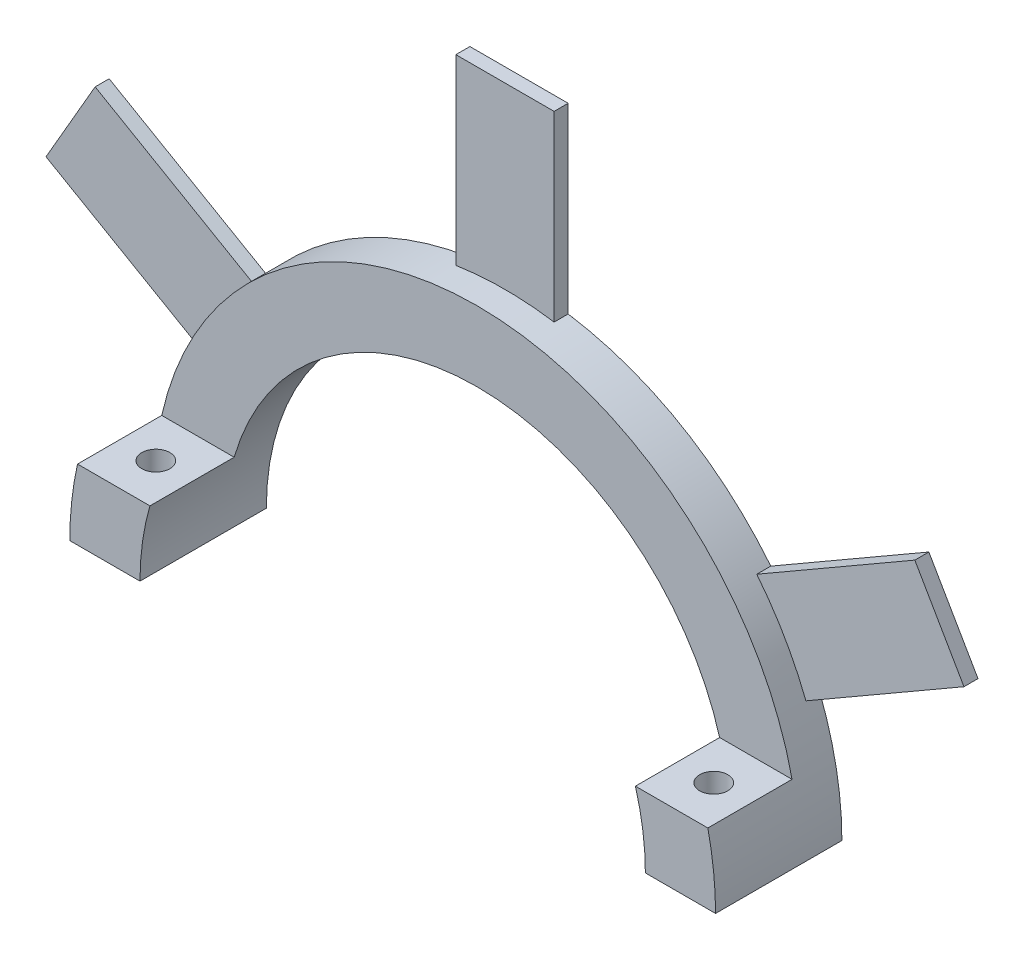
ISO-10303-21;
HEADER;
FILE_DESCRIPTION(('STEP AP214'),'2;1');
FILE_NAME('part.step','',(''),(''),'','','');
FILE_SCHEMA(('AUTOMOTIVE_DESIGN { 1 0 10303 214 1 1 1 1 }'));
ENDSEC;
DATA;
#1=APPLICATION_CONTEXT('core data for automotive mechanical design processes');
#2=APPLICATION_PROTOCOL_DEFINITION('international standard','automotive_design',2000,#1);
#3=PRODUCT_CONTEXT('',#1,'mechanical');
#4=PRODUCT('Part','Part','',(#3));
#5=PRODUCT_RELATED_PRODUCT_CATEGORY('part','',(#4));
#6=PRODUCT_DEFINITION_FORMATION('','',#4);
#7=PRODUCT_DEFINITION_CONTEXT('part definition',#1,'design');
#8=PRODUCT_DEFINITION('design','',#6,#7);
#9=PRODUCT_DEFINITION_SHAPE('','',#8);
#10=(LENGTH_UNIT() NAMED_UNIT(*) SI_UNIT(.MILLI.,.METRE.));
#11=(NAMED_UNIT(*) PLANE_ANGLE_UNIT() SI_UNIT($,.RADIAN.));
#12=(NAMED_UNIT(*) SI_UNIT($,.STERADIAN.) SOLID_ANGLE_UNIT());
#13=UNCERTAINTY_MEASURE_WITH_UNIT(LENGTH_MEASURE(1.E-05),#10,'distance_accuracy_value','');
#14=(GEOMETRIC_REPRESENTATION_CONTEXT(3) GLOBAL_UNCERTAINTY_ASSIGNED_CONTEXT((#13)) GLOBAL_UNIT_ASSIGNED_CONTEXT((#10,
#11,#12)) REPRESENTATION_CONTEXT('',''));
#15=CARTESIAN_POINT('',(0.,0.,0.));
#16=DIRECTION('',(0.,0.,1.));
#17=DIRECTION('',(1.,0.,0.));
#18=AXIS2_PLACEMENT_3D('',#15,#16,#17);
#19=CARTESIAN_POINT('',(0.,0.,3.));
#20=DIRECTION('',(0.,0.,1.));
#21=DIRECTION('',(1.,0.,0.));
#22=AXIS2_PLACEMENT_3D('',#19,#20,#21);
#23=PLANE('',#22);
#24=DIRECTION('',(-1.,0.,0.));
#25=VECTOR('',#24,1.);
#26=CARTESIAN_POINT('',(0.,5.,3.));
#27=LINE('',#26,#25);
#28=CARTESIAN_POINT('',(22.4499443206436,5.,3.));
#29=VERTEX_POINT('',#28);
#30=CARTESIAN_POINT('',(17.2916164657906,5.,3.));
#31=VERTEX_POINT('',#30);
#32=EDGE_CURVE('E363',#29,#31,#27,.T.);
#33=ORIENTED_EDGE('',*,*,#32,.F.);
#34=CARTESIAN_POINT('',(0.,0.,3.));
#35=DIRECTION('',(0.,0.,1.));
#36=DIRECTION('',(1.,0.,0.));
#37=AXIS2_PLACEMENT_3D('',#34,#35,#36);
#38=CIRCLE('',#37,23.);
#39=CARTESIAN_POINT('',(-22.4499443206436,5.,3.));
#40=VERTEX_POINT('',#39);
#41=EDGE_CURVE('E316',#29,#40,#38,.T.);
#42=ORIENTED_EDGE('',*,*,#41,.T.);
#43=DIRECTION('',(1.,0.,0.));
#44=VECTOR('',#43,1.);
#45=CARTESIAN_POINT('',(0.,5.,3.));
#46=LINE('',#45,#44);
#47=CARTESIAN_POINT('',(-17.2916164657906,5.,3.));
#48=VERTEX_POINT('',#47);
#49=EDGE_CURVE('E340',#40,#48,#46,.T.);
#50=ORIENTED_EDGE('',*,*,#49,.T.);
#51=CARTESIAN_POINT('',(0.,0.,3.));
#52=DIRECTION('',(0.,0.,1.));
#53=DIRECTION('',(1.,0.,0.));
#54=AXIS2_PLACEMENT_3D('',#51,#52,#53);
#55=CIRCLE('',#54,18.);
#56=EDGE_CURVE('E318',#31,#48,#55,.T.);
#57=ORIENTED_EDGE('',*,*,#56,.F.);
#58=EDGE_LOOP('',(#33,#42,#50,#57));
#59=FACE_BOUND('',#58,.T.);
#60=ADVANCED_FACE('F40',(#59),#23,.T.);
#61=CARTESIAN_POINT('',(-1.75000000000156,-3.03108891324824,3.));
#62=DIRECTION('',(0.499999999999999,0.866025403784439,0.));
#63=DIRECTION('',(-0.866025403784439,0.499999999999999,0.));
#64=AXIS2_PLACEMENT_3D('',#61,#62,#63);
#65=PLANE('',#64);
#66=DIRECTION('',(0.866025403784439,-0.499999999999999,0.));
#67=VECTOR('',#66,1.);
#68=CARTESIAN_POINT('',(-1.75000000000156,-3.03108891324824,1.));
#69=LINE('',#68,#67);
#70=CARTESIAN_POINT('',(-32.6949373718029,14.8349790084174,1.));
#71=VERTEX_POINT('',#70);
#72=CARTESIAN_POINT('',(-21.4366071226116,8.33497900841983,1.));
#73=VERTEX_POINT('',#72);
#74=EDGE_CURVE('E182',#71,#73,#69,.T.);
#75=ORIENTED_EDGE('',*,*,#74,.F.);
#76=DIRECTION('',(0.,0.,-1.));
#77=VECTOR('',#76,1.);
#78=CARTESIAN_POINT('',(-32.6949373718029,14.8349790084174,3.));
#79=LINE('',#78,#77);
#80=CARTESIAN_POINT('',(-32.6949373718029,14.8349790084174,0.));
#81=VERTEX_POINT('',#80);
#82=EDGE_CURVE('E209',#71,#81,#79,.T.);
#83=ORIENTED_EDGE('',*,*,#82,.T.);
#84=DIRECTION('',(0.866025403784439,-0.499999999999999,0.));
#85=VECTOR('',#84,1.);
#86=CARTESIAN_POINT('',(-1.75000000000156,-3.03108891324824,0.));
#87=LINE('',#86,#85);
#88=CARTESIAN_POINT('',(-21.4366071226084,8.3349790084186,0.));
#89=VERTEX_POINT('',#88);
#90=EDGE_CURVE('E260',#81,#89,#87,.T.);
#91=ORIENTED_EDGE('',*,*,#90,.T.);
#92=DIRECTION('',(0.,0.,-1.));
#93=VECTOR('',#92,1.);
#94=CARTESIAN_POINT('',(-21.4366071226084,8.3349790084186,3.));
#95=LINE('',#94,#93);
#96=EDGE_CURVE('E11',#73,#89,#95,.T.);
#97=ORIENTED_EDGE('',*,*,#96,.F.);
#98=EDGE_LOOP('',(#75,#83,#91,#97));
#99=FACE_BOUND('',#98,.T.);
#100=ADVANCED_FACE('F42',(#99),#65,.F.);
#101=CARTESIAN_POINT('',(1.7499999999976,-3.03108891324137,3.));
#102=DIRECTION('',(0.5,-0.866025403784438,0.));
#103=DIRECTION('',(0.866025403784439,0.5,0.));
#104=AXIS2_PLACEMENT_3D('',#101,#102,#103);
#105=PLANE('',#104);
#106=DIRECTION('',(0.,0.,-1.));
#107=VECTOR('',#106,1.);
#108=CARTESIAN_POINT('',(32.6949373718109,14.8349790084311,3.));
#109=LINE('',#108,#107);
#110=CARTESIAN_POINT('',(32.6949373718109,14.8349790084311,1.));
#111=VERTEX_POINT('',#110);
#112=CARTESIAN_POINT('',(32.6949373718109,14.8349790084311,0.));
#113=VERTEX_POINT('',#112);
#114=EDGE_CURVE('E227',#111,#113,#109,.T.);
#115=ORIENTED_EDGE('',*,*,#114,.F.);
#116=DIRECTION('',(0.866025403784439,0.5,0.));
#117=VECTOR('',#116,1.);
#118=CARTESIAN_POINT('',(1.7499999999976,-3.03108891324137,1.));
#119=LINE('',#118,#117);
#120=CARTESIAN_POINT('',(21.4366071226108,8.33497900842975,1.));
#121=VERTEX_POINT('',#120);
#122=EDGE_CURVE('E403',#121,#111,#119,.T.);
#123=ORIENTED_EDGE('',*,*,#122,.F.);
#124=DIRECTION('',(0.,0.,-1.));
#125=VECTOR('',#124,1.);
#126=CARTESIAN_POINT('',(21.4366071226106,8.33497900843012,3.));
#127=LINE('',#126,#125);
#128=CARTESIAN_POINT('',(21.4366071226106,8.33497900843012,0.));
#129=VERTEX_POINT('',#128);
#130=EDGE_CURVE('E230',#121,#129,#127,.T.);
#131=ORIENTED_EDGE('',*,*,#130,.T.);
#132=DIRECTION('',(-0.866025403784439,-0.5,0.));
#133=VECTOR('',#132,1.);
#134=CARTESIAN_POINT('',(1.7499999999976,-3.03108891324137,0.));
#135=LINE('',#134,#133);
#136=EDGE_CURVE('E277',#113,#129,#135,.T.);
#137=ORIENTED_EDGE('',*,*,#136,.F.);
#138=EDGE_LOOP('',(#115,#123,#131,#137));
#139=FACE_BOUND('',#138,.T.);
#140=ADVANCED_FACE('F450',(#139),#105,.T.);
#141=CARTESIAN_POINT('',(30.9449373718133,17.8660679216725,3.));
#142=DIRECTION('',(0.866025403784438,0.500000000000001,0.));
#143=DIRECTION('',(-0.500000000000001,0.866025403784438,0.));
#144=AXIS2_PLACEMENT_3D('',#141,#142,#143);
#145=PLANE('',#144);
#146=DIRECTION('',(0.,0.,-1.));
#147=VECTOR('',#146,1.);
#148=CARTESIAN_POINT('',(29.1949373718109,20.8971568349222,3.));
#149=LINE('',#148,#147);
#150=CARTESIAN_POINT('',(29.1949373718109,20.8971568349222,1.));
#151=VERTEX_POINT('',#150);
#152=CARTESIAN_POINT('',(29.1949373718109,20.8971568349222,0.));
#153=VERTEX_POINT('',#152);
#154=EDGE_CURVE('E224',#151,#153,#149,.T.);
#155=ORIENTED_EDGE('',*,*,#154,.F.);
#156=DIRECTION('',(-0.500000000000001,0.866025403784438,0.));
#157=VECTOR('',#156,1.);
#158=CARTESIAN_POINT('',(30.9449373718133,17.8660679216725,1.));
#159=LINE('',#158,#157);
#160=EDGE_CURVE('E400',#111,#151,#159,.T.);
#161=ORIENTED_EDGE('',*,*,#160,.F.);
#162=ORIENTED_EDGE('',*,*,#114,.T.);
#163=DIRECTION('',(0.500000000000001,-0.866025403784438,0.));
#164=VECTOR('',#163,1.);
#165=CARTESIAN_POINT('',(30.9449373718133,17.8660679216725,0.));
#166=LINE('',#165,#164);
#167=EDGE_CURVE('E282',#153,#113,#166,.T.);
#168=ORIENTED_EDGE('',*,*,#167,.F.);
#169=EDGE_LOOP('',(#155,#161,#162,#168));
#170=FACE_BOUND('',#169,.T.);
#171=ADVANCED_FACE('F442',(#170),#145,.T.);
#172=CARTESIAN_POINT('',(-1.7500000000024,3.0310889132497,3.));
#173=DIRECTION('',(0.5,-0.866025403784438,0.));
#174=DIRECTION('',(0.866025403784439,0.5,0.));
#175=AXIS2_PLACEMENT_3D('',#172,#173,#174);
#176=PLANE('',#175);
#177=DIRECTION('',(-0.866025403784439,-0.5,0.));
#178=VECTOR('',#177,1.);
#179=CARTESIAN_POINT('',(-1.7500000000024,3.0310889132497,1.));
#180=LINE('',#179,#178);
#181=CARTESIAN_POINT('',(17.9366071226104,14.39715683492,1.));
#182=VERTEX_POINT('',#181);
#183=EDGE_CURVE('E56',#151,#182,#180,.T.);
#184=ORIENTED_EDGE('',*,*,#183,.F.);
#185=ORIENTED_EDGE('',*,*,#154,.T.);
#186=DIRECTION('',(-0.866025403784439,-0.5,0.));
#187=VECTOR('',#186,1.);
#188=CARTESIAN_POINT('',(-1.7500000000024,3.0310889132497,0.));
#189=LINE('',#188,#187);
#190=CARTESIAN_POINT('',(17.9366071226104,14.39715683492,0.));
#191=VERTEX_POINT('',#190);
#192=EDGE_CURVE('E288',#153,#191,#189,.T.);
#193=ORIENTED_EDGE('',*,*,#192,.T.);
#194=DIRECTION('',(0.,0.,-1.));
#195=VECTOR('',#194,1.);
#196=CARTESIAN_POINT('',(17.9366071226104,14.39715683492,3.));
#197=LINE('',#196,#195);
#198=EDGE_CURVE('E221',#182,#191,#197,.T.);
#199=ORIENTED_EDGE('',*,*,#198,.F.);
#200=EDGE_LOOP('',(#184,#185,#193,#199));
#201=FACE_BOUND('',#200,.T.);
#202=ADVANCED_FACE('F507',(#201),#176,.F.);
#203=CARTESIAN_POINT('',(3.5,0.,3.));
#204=DIRECTION('',(1.,0.,0.));
#205=DIRECTION('',(0.,1.,0.));
#206=AXIS2_PLACEMENT_3D('',#203,#204,#205);
#207=PLANE('',#206);
#208=DIRECTION('',(0.,0.,-1.));
#209=VECTOR('',#208,1.);
#210=CARTESIAN_POINT('',(3.5,35.7321358433386,3.));
#211=LINE('',#210,#209);
#212=CARTESIAN_POINT('',(3.5,35.7321358433386,1.));
#213=VERTEX_POINT('',#212);
#214=CARTESIAN_POINT('',(3.5,35.7321358433386,0.));
#215=VERTEX_POINT('',#214);
#216=EDGE_CURVE('E215',#213,#215,#211,.T.);
#217=ORIENTED_EDGE('',*,*,#216,.F.);
#218=DIRECTION('',(0.,1.,0.));
#219=VECTOR('',#218,1.);
#220=CARTESIAN_POINT('',(3.5,0.,1.));
#221=LINE('',#220,#219);
#222=CARTESIAN_POINT('',(3.5,22.7321358433386,1.));
#223=VERTEX_POINT('',#222);
#224=EDGE_CURVE('E414',#223,#213,#221,.T.);
#225=ORIENTED_EDGE('',*,*,#224,.F.);
#226=DIRECTION('',(0.,0.,-1.));
#227=VECTOR('',#226,1.);
#228=CARTESIAN_POINT('',(3.5,22.7321358433386,3.));
#229=LINE('',#228,#227);
#230=CARTESIAN_POINT('',(3.5,22.7321358433386,0.));
#231=VERTEX_POINT('',#230);
#232=EDGE_CURVE('E218',#223,#231,#229,.T.);
#233=ORIENTED_EDGE('',*,*,#232,.T.);
#234=DIRECTION('',(0.,-1.,0.));
#235=VECTOR('',#234,1.);
#236=CARTESIAN_POINT('',(3.5,0.,0.));
#237=LINE('',#236,#235);
#238=EDGE_CURVE('E287',#215,#231,#237,.T.);
#239=ORIENTED_EDGE('',*,*,#238,.F.);
#240=EDGE_LOOP('',(#217,#225,#233,#239));
#241=FACE_BOUND('',#240,.T.);
#242=ADVANCED_FACE('F434',(#241),#207,.T.);
#243=CARTESIAN_POINT('',(0.,35.7321358433386,3.));
#244=DIRECTION('',(0.,1.,0.));
#245=DIRECTION('',(0.,0.,1.));
#246=AXIS2_PLACEMENT_3D('',#243,#244,#245);
#247=PLANE('',#246);
#248=DIRECTION('',(0.,0.,-1.));
#249=VECTOR('',#248,1.);
#250=CARTESIAN_POINT('',(-3.5,35.7321358433386,3.));
#251=LINE('',#250,#249);
#252=CARTESIAN_POINT('',(-3.5,35.7321358433386,1.));
#253=VERTEX_POINT('',#252);
#254=CARTESIAN_POINT('',(-3.5,35.7321358433386,0.));
#255=VERTEX_POINT('',#254);
#256=EDGE_CURVE('E207',#253,#255,#251,.T.);
#257=ORIENTED_EDGE('',*,*,#256,.F.);
#258=DIRECTION('',(-1.,0.,0.));
#259=VECTOR('',#258,1.);
#260=CARTESIAN_POINT('',(0.,35.7321358433386,1.));
#261=LINE('',#260,#259);
#262=EDGE_CURVE('E411',#213,#253,#261,.T.);
#263=ORIENTED_EDGE('',*,*,#262,.F.);
#264=ORIENTED_EDGE('',*,*,#216,.T.);
#265=DIRECTION('',(1.,0.,0.));
#266=VECTOR('',#265,1.);
#267=CARTESIAN_POINT('',(0.,35.7321358433386,0.));
#268=LINE('',#267,#266);
#269=EDGE_CURVE('E294',#255,#215,#268,.T.);
#270=ORIENTED_EDGE('',*,*,#269,.F.);
#271=EDGE_LOOP('',(#257,#263,#264,#270));
#272=FACE_BOUND('',#271,.T.);
#273=ADVANCED_FACE('F428',(#272),#247,.T.);
#274=CARTESIAN_POINT('',(-3.49999999999999,0.,3.));
#275=DIRECTION('',(1.,0.,0.));
#276=DIRECTION('',(0.,1.,0.));
#277=AXIS2_PLACEMENT_3D('',#274,#275,#276);
#278=PLANE('',#277);
#279=DIRECTION('',(0.,-1.,0.));
#280=VECTOR('',#279,1.);
#281=CARTESIAN_POINT('',(-3.49999999999999,0.,1.));
#282=LINE('',#281,#280);
#283=CARTESIAN_POINT('',(-3.5,22.7321358433386,1.));
#284=VERTEX_POINT('',#283);
#285=EDGE_CURVE('E64',#253,#284,#282,.T.);
#286=ORIENTED_EDGE('',*,*,#285,.F.);
#287=ORIENTED_EDGE('',*,*,#256,.T.);
#288=DIRECTION('',(0.,-1.,0.));
#289=VECTOR('',#288,1.);
#290=CARTESIAN_POINT('',(-3.49999999999999,0.,0.));
#291=LINE('',#290,#289);
#292=CARTESIAN_POINT('',(-3.5,22.7321358433386,0.));
#293=VERTEX_POINT('',#292);
#294=EDGE_CURVE('E300',#255,#293,#291,.T.);
#295=ORIENTED_EDGE('',*,*,#294,.T.);
#296=DIRECTION('',(0.,0.,-1.));
#297=VECTOR('',#296,1.);
#298=CARTESIAN_POINT('',(-3.5,22.7321358433386,3.));
#299=LINE('',#298,#297);
#300=EDGE_CURVE('E203',#284,#293,#299,.T.);
#301=ORIENTED_EDGE('',*,*,#300,.F.);
#302=EDGE_LOOP('',(#286,#287,#295,#301));
#303=FACE_BOUND('',#302,.T.);
#304=ADVANCED_FACE('F498',(#303),#278,.F.);
#305=CARTESIAN_POINT('',(1.74999999999843,3.03108891324283,3.));
#306=DIRECTION('',(0.499999999999999,0.866025403784439,0.));
#307=DIRECTION('',(-0.866025403784439,0.499999999999999,0.));
#308=AXIS2_PLACEMENT_3D('',#305,#306,#307);
#309=PLANE('',#308);
#310=DIRECTION('',(0.,0.,-1.));
#311=VECTOR('',#310,1.);
#312=CARTESIAN_POINT('',(-29.1949373718029,20.8971568349084,3.));
#313=LINE('',#312,#311);
#314=CARTESIAN_POINT('',(-29.1949373718029,20.8971568349084,1.));
#315=VERTEX_POINT('',#314);
#316=CARTESIAN_POINT('',(-29.1949373718029,20.8971568349084,0.));
#317=VERTEX_POINT('',#316);
#318=EDGE_CURVE('E194',#315,#317,#313,.T.);
#319=ORIENTED_EDGE('',*,*,#318,.F.);
#320=DIRECTION('',(-0.866025403784439,0.499999999999999,0.));
#321=VECTOR('',#320,1.);
#322=CARTESIAN_POINT('',(1.74999999999843,3.03108891324283,1.));
#323=LINE('',#322,#321);
#324=CARTESIAN_POINT('',(-17.9366071226086,14.3971568349104,1.));
#325=VERTEX_POINT('',#324);
#326=EDGE_CURVE('E179',#325,#315,#323,.T.);
#327=ORIENTED_EDGE('',*,*,#326,.F.);
#328=DIRECTION('',(0.,0.,-1.));
#329=VECTOR('',#328,1.);
#330=CARTESIAN_POINT('',(-17.9366071226083,14.3971568349109,3.));
#331=LINE('',#330,#329);
#332=CARTESIAN_POINT('',(-17.9366071226083,14.3971568349109,0.));
#333=VERTEX_POINT('',#332);
#334=EDGE_CURVE('E192',#325,#333,#331,.T.);
#335=ORIENTED_EDGE('',*,*,#334,.T.);
#336=DIRECTION('',(0.866025403784439,-0.499999999999999,0.));
#337=VECTOR('',#336,1.);
#338=CARTESIAN_POINT('',(1.74999999999843,3.03108891324283,0.));
#339=LINE('',#338,#337);
#340=EDGE_CURVE('E299',#317,#333,#339,.T.);
#341=ORIENTED_EDGE('',*,*,#340,.F.);
#342=EDGE_LOOP('',(#319,#327,#335,#341));
#343=FACE_BOUND('',#342,.T.);
#344=ADVANCED_FACE('F190',(#343),#309,.T.);
#345=CARTESIAN_POINT('',(-30.9449373718014,17.8660679216656,3.));
#346=DIRECTION('',(-0.866025403784439,0.5,0.));
#347=DIRECTION('',(-0.5,-0.866025403784439,0.));
#348=AXIS2_PLACEMENT_3D('',#345,#346,#347);
#349=PLANE('',#348);
#350=ORIENTED_EDGE('',*,*,#82,.F.);
#351=DIRECTION('',(-0.5,-0.866025403784439,0.));
#352=VECTOR('',#351,1.);
#353=CARTESIAN_POINT('',(-30.9449373718014,17.8660679216656,1.));
#354=LINE('',#353,#352);
#355=EDGE_CURVE('E196',#315,#71,#354,.T.);
#356=ORIENTED_EDGE('',*,*,#355,.F.);
#357=ORIENTED_EDGE('',*,*,#318,.T.);
#358=DIRECTION('',(0.5,0.866025403784439,0.));
#359=VECTOR('',#358,1.);
#360=CARTESIAN_POINT('',(-30.9449373718014,17.8660679216656,0.));
#361=LINE('',#360,#359);
#362=EDGE_CURVE('E303',#81,#317,#361,.T.);
#363=ORIENTED_EDGE('',*,*,#362,.F.);
#364=EDGE_LOOP('',(#350,#356,#357,#363));
#365=FACE_BOUND('',#364,.T.);
#366=ADVANCED_FACE('F424',(#365),#349,.T.);
#367=CARTESIAN_POINT('',(0.,0.,3.));
#368=DIRECTION('',(0.,-1.,0.));
#369=DIRECTION('',(0.,0.,-1.));
#370=AXIS2_PLACEMENT_3D('',#367,#368,#369);
#371=PLANE('',#370);
#372=CARTESIAN_POINT('',(-19.8707803932171,0.,6.));
#373=DIRECTION('',(0.,1.,0.));
#374=DIRECTION('',(0.,0.,1.));
#375=AXIS2_PLACEMENT_3D('',#372,#373,#374);
#376=CIRCLE('',#375,1.);
#377=CARTESIAN_POINT('',(-19.8707803932171,0.,7.));
#378=VERTEX_POINT('',#377);
#379=EDGE_CURVE('E368',#378,#378,#376,.T.);
#380=ORIENTED_EDGE('',*,*,#379,.T.);
#381=EDGE_LOOP('',(#380));
#382=FACE_BOUND('',#381,.T.);
#383=DIRECTION('',(-1.,0.,0.));
#384=VECTOR('',#383,1.);
#385=CARTESIAN_POINT('',(0.,0.,0.));
#386=LINE('',#385,#384);
#387=CARTESIAN_POINT('',(-18.,0.,0.));
#388=VERTEX_POINT('',#387);
#389=CARTESIAN_POINT('',(-23.,0.,0.));
#390=VERTEX_POINT('',#389);
#391=EDGE_CURVE('E248',#388,#390,#386,.T.);
#392=ORIENTED_EDGE('',*,*,#391,.F.);
#393=DIRECTION('',(0.,0.,-1.));
#394=VECTOR('',#393,1.);
#395=CARTESIAN_POINT('',(-18.,0.,3.));
#396=LINE('',#395,#394);
#397=CARTESIAN_POINT('',(-18.,0.,9.));
#398=VERTEX_POINT('',#397);
#399=EDGE_CURVE('E239',#398,#388,#396,.T.);
#400=ORIENTED_EDGE('',*,*,#399,.F.);
#401=DIRECTION('',(1.,0.,0.));
#402=VECTOR('',#401,1.);
#403=CARTESIAN_POINT('',(0.,0.,9.));
#404=LINE('',#403,#402);
#405=CARTESIAN_POINT('',(-23.,0.,9.));
#406=VERTEX_POINT('',#405);
#407=EDGE_CURVE('E251',#406,#398,#404,.T.);
#408=ORIENTED_EDGE('',*,*,#407,.F.);
#409=DIRECTION('',(0.,0.,-1.));
#410=VECTOR('',#409,1.);
#411=CARTESIAN_POINT('',(-23.,0.,3.));
#412=LINE('',#411,#410);
#413=EDGE_CURVE('E49',#406,#390,#412,.T.);
#414=ORIENTED_EDGE('',*,*,#413,.T.);
#415=EDGE_LOOP('',(#392,#400,#408,#414));
#416=FACE_BOUND('',#415,.T.);
#417=ADVANCED_FACE('F246',(#382,#416),#371,.T.);
#418=CARTESIAN_POINT('',(0.,0.,3.));
#419=DIRECTION('',(0.,0.,-1.));
#420=DIRECTION('',(-1.,0.,0.));
#421=AXIS2_PLACEMENT_3D('',#418,#419,#420);
#422=CYLINDRICAL_SURFACE('',#421,18.);
#423=CARTESIAN_POINT('',(0.,0.,0.));
#424=DIRECTION('',(0.,0.,1.));
#425=DIRECTION('',(1.,0.,0.));
#426=AXIS2_PLACEMENT_3D('',#423,#424,#425);
#427=CIRCLE('',#426,18.);
#428=CARTESIAN_POINT('',(18.,0.,0.));
#429=VERTEX_POINT('',#428);
#430=EDGE_CURVE('E266',#429,#388,#427,.T.);
#431=ORIENTED_EDGE('',*,*,#430,.F.);
#432=DIRECTION('',(0.,0.,-1.));
#433=VECTOR('',#432,1.);
#434=CARTESIAN_POINT('',(18.,0.,3.));
#435=LINE('',#434,#433);
#436=CARTESIAN_POINT('',(18.,0.,9.));
#437=VERTEX_POINT('',#436);
#438=EDGE_CURVE('E236',#437,#429,#435,.T.);
#439=ORIENTED_EDGE('',*,*,#438,.F.);
#440=CARTESIAN_POINT('',(0.,0.,9.));
#441=DIRECTION('',(0.,0.,1.));
#442=DIRECTION('',(1.,0.,0.));
#443=AXIS2_PLACEMENT_3D('',#440,#441,#442);
#444=CIRCLE('',#443,18.);
#445=CARTESIAN_POINT('',(17.2916164657906,5.,9.));
#446=VERTEX_POINT('',#445);
#447=EDGE_CURVE('E372',#446,#437,#444,.F.);
#448=ORIENTED_EDGE('',*,*,#447,.F.);
#449=DIRECTION('',(0.,0.,-1.));
#450=VECTOR('',#449,1.);
#451=CARTESIAN_POINT('',(17.2916164657906,5.,9.));
#452=LINE('',#451,#450);
#453=EDGE_CURVE('E359',#446,#31,#452,.T.);
#454=ORIENTED_EDGE('',*,*,#453,.T.);
#455=ORIENTED_EDGE('',*,*,#56,.T.);
#456=DIRECTION('',(0.,0.,-1.));
#457=VECTOR('',#456,1.);
#458=CARTESIAN_POINT('',(-17.2916164657906,5.,9.));
#459=LINE('',#458,#457);
#460=CARTESIAN_POINT('',(-17.2916164657906,5.,9.));
#461=VERTEX_POINT('',#460);
#462=EDGE_CURVE('E334',#461,#48,#459,.T.);
#463=ORIENTED_EDGE('',*,*,#462,.F.);
#464=CARTESIAN_POINT('',(0.,0.,9.));
#465=DIRECTION('',(0.,0.,1.));
#466=DIRECTION('',(1.,0.,0.));
#467=AXIS2_PLACEMENT_3D('',#464,#465,#466);
#468=CIRCLE('',#467,18.);
#469=EDGE_CURVE('E337',#398,#461,#468,.F.);
#470=ORIENTED_EDGE('',*,*,#469,.F.);
#471=ORIENTED_EDGE('',*,*,#399,.T.);
#472=EDGE_LOOP('',(#431,#439,#448,#454,#455,#463,#470,#471));
#473=FACE_BOUND('',#472,.T.);
#474=ADVANCED_FACE('F455',(#473),#422,.F.);
#475=CARTESIAN_POINT('',(19.8707803932171,0.,5.99999999999999));
#476=DIRECTION('',(0.,1.,0.));
#477=DIRECTION('',(0.,0.,-1.));
#478=AXIS2_PLACEMENT_3D('',#475,#476,#477);
#479=CIRCLE('',#478,1.);
#480=CARTESIAN_POINT('',(19.8707803932171,0.,4.99999999999999));
#481=VERTEX_POINT('',#480);
#482=EDGE_CURVE('E386',#481,#481,#479,.T.);
#483=ORIENTED_EDGE('',*,*,#482,.T.);
#484=EDGE_LOOP('',(#483));
#485=FACE_BOUND('',#484,.T.);
#486=CARTESIAN_POINT('',(23.,0.,0.));
#487=VERTEX_POINT('',#486);
#488=EDGE_CURVE('E269',#487,#429,#386,.T.);
#489=ORIENTED_EDGE('',*,*,#488,.F.);
#490=DIRECTION('',(0.,0.,-1.));
#491=VECTOR('',#490,1.);
#492=CARTESIAN_POINT('',(23.,0.,3.));
#493=LINE('',#492,#491);
#494=CARTESIAN_POINT('',(23.,0.,9.));
#495=VERTEX_POINT('',#494);
#496=EDGE_CURVE('E233',#495,#487,#493,.T.);
#497=ORIENTED_EDGE('',*,*,#496,.F.);
#498=DIRECTION('',(1.,0.,0.));
#499=VECTOR('',#498,1.);
#500=CARTESIAN_POINT('',(0.,0.,9.));
#501=LINE('',#500,#499);
#502=EDGE_CURVE('E362',#437,#495,#501,.T.);
#503=ORIENTED_EDGE('',*,*,#502,.F.);
#504=ORIENTED_EDGE('',*,*,#438,.T.);
#505=EDGE_LOOP('',(#489,#497,#503,#504));
#506=FACE_BOUND('',#505,.T.);
#507=ADVANCED_FACE('F452',(#485,#506),#371,.T.);
#508=CARTESIAN_POINT('',(0.,0.,3.));
#509=DIRECTION('',(0.,0.,-1.));
#510=DIRECTION('',(-1.,0.,0.));
#511=AXIS2_PLACEMENT_3D('',#508,#509,#510);
#512=CYLINDRICAL_SURFACE('',#511,23.);
#513=CARTESIAN_POINT('',(0.,0.,0.));
#514=DIRECTION('',(0.,0.,1.));
#515=DIRECTION('',(1.,0.,0.));
#516=AXIS2_PLACEMENT_3D('',#513,#514,#515);
#517=CIRCLE('',#516,23.);
#518=EDGE_CURVE('E200',#293,#333,#517,.T.);
#519=ORIENTED_EDGE('',*,*,#518,.T.);
#520=ORIENTED_EDGE('',*,*,#334,.F.);
#521=CARTESIAN_POINT('',(0.,0.,1.));
#522=DIRECTION('',(0.,0.,1.));
#523=DIRECTION('',(1.,0.,0.));
#524=AXIS2_PLACEMENT_3D('',#521,#522,#523);
#525=CIRCLE('',#524,23.);
#526=EDGE_CURVE('E176',#325,#73,#525,.T.);
#527=ORIENTED_EDGE('',*,*,#526,.T.);
#528=ORIENTED_EDGE('',*,*,#96,.T.);
#529=EDGE_CURVE('E255',#89,#390,#517,.T.);
#530=ORIENTED_EDGE('',*,*,#529,.T.);
#531=ORIENTED_EDGE('',*,*,#413,.F.);
#532=CARTESIAN_POINT('',(0.,0.,9.));
#533=DIRECTION('',(0.,0.,1.));
#534=DIRECTION('',(1.,0.,0.));
#535=AXIS2_PLACEMENT_3D('',#532,#533,#534);
#536=CIRCLE('',#535,23.);
#537=CARTESIAN_POINT('',(-22.4499443206436,5.,9.));
#538=VERTEX_POINT('',#537);
#539=EDGE_CURVE('E350',#538,#406,#536,.T.);
#540=ORIENTED_EDGE('',*,*,#539,.F.);
#541=DIRECTION('',(0.,0.,-1.));
#542=VECTOR('',#541,1.);
#543=CARTESIAN_POINT('',(-22.4499443206436,5.,9.));
#544=LINE('',#543,#542);
#545=EDGE_CURVE('E332',#538,#40,#544,.T.);
#546=ORIENTED_EDGE('',*,*,#545,.T.);
#547=ORIENTED_EDGE('',*,*,#41,.F.);
#548=DIRECTION('',(0.,0.,-1.));
#549=VECTOR('',#548,1.);
#550=CARTESIAN_POINT('',(22.4499443206436,5.,9.));
#551=LINE('',#550,#549);
#552=CARTESIAN_POINT('',(22.4499443206436,5.,9.));
#553=VERTEX_POINT('',#552);
#554=EDGE_CURVE('E345',#553,#29,#551,.T.);
#555=ORIENTED_EDGE('',*,*,#554,.F.);
#556=CARTESIAN_POINT('',(0.,0.,9.));
#557=DIRECTION('',(0.,0.,1.));
#558=DIRECTION('',(1.,0.,0.));
#559=AXIS2_PLACEMENT_3D('',#556,#557,#558);
#560=CIRCLE('',#559,23.);
#561=EDGE_CURVE('E367',#495,#553,#560,.T.);
#562=ORIENTED_EDGE('',*,*,#561,.F.);
#563=ORIENTED_EDGE('',*,*,#496,.T.);
#564=EDGE_CURVE('E262',#487,#129,#517,.T.);
#565=ORIENTED_EDGE('',*,*,#564,.T.);
#566=ORIENTED_EDGE('',*,*,#130,.F.);
#567=CARTESIAN_POINT('',(0.,0.,1.));
#568=DIRECTION('',(0.,0.,1.));
#569=DIRECTION('',(1.,0.,0.));
#570=AXIS2_PLACEMENT_3D('',#567,#568,#569);
#571=CIRCLE('',#570,23.);
#572=EDGE_CURVE('E406',#121,#182,#571,.T.);
#573=ORIENTED_EDGE('',*,*,#572,.T.);
#574=ORIENTED_EDGE('',*,*,#198,.T.);
#575=EDGE_CURVE('E278',#191,#231,#517,.T.);
#576=ORIENTED_EDGE('',*,*,#575,.T.);
#577=ORIENTED_EDGE('',*,*,#232,.F.);
#578=CARTESIAN_POINT('',(0.,0.,1.));
#579=DIRECTION('',(0.,0.,1.));
#580=DIRECTION('',(1.,0.,0.));
#581=AXIS2_PLACEMENT_3D('',#578,#579,#580);
#582=CIRCLE('',#581,23.);
#583=EDGE_CURVE('E399',#223,#284,#582,.T.);
#584=ORIENTED_EDGE('',*,*,#583,.T.);
#585=ORIENTED_EDGE('',*,*,#300,.T.);
#586=EDGE_LOOP('',(#519,#520,#527,#528,#530,#531,#540,#546,#547,#555,#562,#563,#565,#566,#573,
#574,#576,#577,#584,#585));
#587=FACE_BOUND('',#586,.T.);
#588=ADVANCED_FACE('F198',(#587),#512,.T.);
#589=CARTESIAN_POINT('',(0.,0.,0.));
#590=DIRECTION('',(0.,0.,1.));
#591=DIRECTION('',(1.,0.,0.));
#592=AXIS2_PLACEMENT_3D('',#589,#590,#591);
#593=PLANE('',#592);
#594=ORIENTED_EDGE('',*,*,#90,.F.);
#595=ORIENTED_EDGE('',*,*,#362,.T.);
#596=ORIENTED_EDGE('',*,*,#340,.T.);
#597=ORIENTED_EDGE('',*,*,#518,.F.);
#598=ORIENTED_EDGE('',*,*,#294,.F.);
#599=ORIENTED_EDGE('',*,*,#269,.T.);
#600=ORIENTED_EDGE('',*,*,#238,.T.);
#601=ORIENTED_EDGE('',*,*,#575,.F.);
#602=ORIENTED_EDGE('',*,*,#192,.F.);
#603=ORIENTED_EDGE('',*,*,#167,.T.);
#604=ORIENTED_EDGE('',*,*,#136,.T.);
#605=ORIENTED_EDGE('',*,*,#564,.F.);
#606=ORIENTED_EDGE('',*,*,#488,.T.);
#607=ORIENTED_EDGE('',*,*,#430,.T.);
#608=ORIENTED_EDGE('',*,*,#391,.T.);
#609=ORIENTED_EDGE('',*,*,#529,.F.);
#610=EDGE_LOOP('',(#594,#595,#596,#597,#598,#599,#600,#601,#602,#603,#604,#605,#606,#607,#608,#609));
#611=FACE_BOUND('',#610,.T.);
#612=ADVANCED_FACE('F263',(#611),#593,.F.);
#613=CARTESIAN_POINT('',(0.,5.,9.));
#614=DIRECTION('',(0.,1.,0.));
#615=DIRECTION('',(0.,0.,1.));
#616=AXIS2_PLACEMENT_3D('',#613,#614,#615);
#617=PLANE('',#616);
#618=CARTESIAN_POINT('',(-19.8707803932171,5.,6.));
#619=DIRECTION('',(0.,1.,0.));
#620=DIRECTION('',(0.,0.,1.));
#621=AXIS2_PLACEMENT_3D('',#618,#619,#620);
#622=CIRCLE('',#621,1.);
#623=CARTESIAN_POINT('',(-19.8707803932171,5.,7.));
#624=VERTEX_POINT('',#623);
#625=EDGE_CURVE('E390',#624,#624,#622,.T.);
#626=ORIENTED_EDGE('',*,*,#625,.F.);
#627=EDGE_LOOP('',(#626));
#628=FACE_BOUND('',#627,.T.);
#629=ORIENTED_EDGE('',*,*,#49,.F.);
#630=ORIENTED_EDGE('',*,*,#545,.F.);
#631=DIRECTION('',(1.,0.,0.));
#632=VECTOR('',#631,1.);
#633=CARTESIAN_POINT('',(0.,5.,9.));
#634=LINE('',#633,#632);
#635=EDGE_CURVE('E344',#538,#461,#634,.T.);
#636=ORIENTED_EDGE('',*,*,#635,.T.);
#637=ORIENTED_EDGE('',*,*,#462,.T.);
#638=EDGE_LOOP('',(#629,#630,#636,#637));
#639=FACE_BOUND('',#638,.T.);
#640=ADVANCED_FACE('F461',(#628,#639),#617,.T.);
#641=CARTESIAN_POINT('',(0.,0.,9.));
#642=DIRECTION('',(0.,0.,1.));
#643=DIRECTION('',(1.,0.,0.));
#644=AXIS2_PLACEMENT_3D('',#641,#642,#643);
#645=PLANE('',#644);
#646=ORIENTED_EDGE('',*,*,#635,.F.);
#647=ORIENTED_EDGE('',*,*,#539,.T.);
#648=ORIENTED_EDGE('',*,*,#407,.T.);
#649=ORIENTED_EDGE('',*,*,#469,.T.);
#650=EDGE_LOOP('',(#646,#647,#648,#649));
#651=FACE_BOUND('',#650,.T.);
#652=ADVANCED_FACE('F459',(#651),#645,.T.);
#653=CARTESIAN_POINT('',(0.,5.,9.));
#654=DIRECTION('',(0.,-1.,0.));
#655=DIRECTION('',(0.,0.,-1.));
#656=AXIS2_PLACEMENT_3D('',#653,#654,#655);
#657=PLANE('',#656);
#658=CARTESIAN_POINT('',(19.8707803932171,5.,5.99999999999999));
#659=DIRECTION('',(0.,1.,0.));
#660=DIRECTION('',(0.,0.,-1.));
#661=AXIS2_PLACEMENT_3D('',#658,#659,#660);
#662=CIRCLE('',#661,1.);
#663=CARTESIAN_POINT('',(19.8707803932171,5.,4.99999999999999));
#664=VERTEX_POINT('',#663);
#665=EDGE_CURVE('E382',#664,#664,#662,.T.);
#666=ORIENTED_EDGE('',*,*,#665,.F.);
#667=EDGE_LOOP('',(#666));
#668=FACE_BOUND('',#667,.T.);
#669=ORIENTED_EDGE('',*,*,#32,.T.);
#670=ORIENTED_EDGE('',*,*,#453,.F.);
#671=DIRECTION('',(-1.,0.,0.));
#672=VECTOR('',#671,1.);
#673=CARTESIAN_POINT('',(0.,5.,9.));
#674=LINE('',#673,#672);
#675=EDGE_CURVE('E376',#553,#446,#674,.T.);
#676=ORIENTED_EDGE('',*,*,#675,.F.);
#677=ORIENTED_EDGE('',*,*,#554,.T.);
#678=EDGE_LOOP('',(#669,#670,#676,#677));
#679=FACE_BOUND('',#678,.T.);
#680=ADVANCED_FACE('F467',(#668,#679),#657,.F.);
#681=CARTESIAN_POINT('',(0.,0.,9.));
#682=DIRECTION('',(0.,0.,1.));
#683=DIRECTION('',(1.,0.,0.));
#684=AXIS2_PLACEMENT_3D('',#681,#682,#683);
#685=PLANE('',#684);
#686=ORIENTED_EDGE('',*,*,#561,.T.);
#687=ORIENTED_EDGE('',*,*,#675,.T.);
#688=ORIENTED_EDGE('',*,*,#447,.T.);
#689=ORIENTED_EDGE('',*,*,#502,.T.);
#690=EDGE_LOOP('',(#686,#687,#688,#689));
#691=FACE_BOUND('',#690,.T.);
#692=ADVANCED_FACE('F470',(#691),#685,.T.);
#693=CARTESIAN_POINT('',(19.8707803932171,0.,5.99999999999999));
#694=DIRECTION('',(0.,1.,0.));
#695=DIRECTION('',(0.,0.,1.));
#696=AXIS2_PLACEMENT_3D('',#693,#694,#695);
#697=CYLINDRICAL_SURFACE('',#696,1.);
#698=ORIENTED_EDGE('',*,*,#482,.F.);
#699=EDGE_LOOP('',(#698));
#700=FACE_BOUND('',#699,.T.);
#701=ORIENTED_EDGE('',*,*,#665,.T.);
#702=EDGE_LOOP('',(#701));
#703=FACE_BOUND('',#702,.T.);
#704=ADVANCED_FACE('F472',(#700,#703),#697,.F.);
#705=CARTESIAN_POINT('',(-19.8707803932171,0.,6.));
#706=DIRECTION('',(0.,1.,0.));
#707=DIRECTION('',(0.,0.,1.));
#708=AXIS2_PLACEMENT_3D('',#705,#706,#707);
#709=CYLINDRICAL_SURFACE('',#708,1.);
#710=ORIENTED_EDGE('',*,*,#379,.F.);
#711=EDGE_LOOP('',(#710));
#712=FACE_BOUND('',#711,.T.);
#713=ORIENTED_EDGE('',*,*,#625,.T.);
#714=EDGE_LOOP('',(#713));
#715=FACE_BOUND('',#714,.T.);
#716=ADVANCED_FACE('F478',(#712,#715),#709,.F.);
#717=CARTESIAN_POINT('',(0.,0.,1.));
#718=DIRECTION('',(0.,0.,1.));
#719=DIRECTION('',(1.,0.,0.));
#720=AXIS2_PLACEMENT_3D('',#717,#718,#719);
#721=PLANE('',#720);
#722=ORIENTED_EDGE('',*,*,#526,.F.);
#723=ORIENTED_EDGE('',*,*,#326,.T.);
#724=ORIENTED_EDGE('',*,*,#355,.T.);
#725=ORIENTED_EDGE('',*,*,#74,.T.);
#726=EDGE_LOOP('',(#722,#723,#724,#725));
#727=FACE_BOUND('',#726,.T.);
#728=ADVANCED_FACE('F178',(#727),#721,.T.);
#729=CARTESIAN_POINT('',(0.,0.,1.));
#730=DIRECTION('',(0.,0.,1.));
#731=DIRECTION('',(1.,0.,0.));
#732=AXIS2_PLACEMENT_3D('',#729,#730,#731);
#733=PLANE('',#732);
#734=ORIENTED_EDGE('',*,*,#583,.F.);
#735=ORIENTED_EDGE('',*,*,#224,.T.);
#736=ORIENTED_EDGE('',*,*,#262,.T.);
#737=ORIENTED_EDGE('',*,*,#285,.T.);
#738=EDGE_LOOP('',(#734,#735,#736,#737));
#739=FACE_BOUND('',#738,.T.);
#740=ADVANCED_FACE('F618',(#739),#733,.T.);
#741=CARTESIAN_POINT('',(0.,0.,1.));
#742=DIRECTION('',(0.,0.,1.));
#743=DIRECTION('',(1.,0.,0.));
#744=AXIS2_PLACEMENT_3D('',#741,#742,#743);
#745=PLANE('',#744);
#746=ORIENTED_EDGE('',*,*,#572,.F.);
#747=ORIENTED_EDGE('',*,*,#122,.T.);
#748=ORIENTED_EDGE('',*,*,#160,.T.);
#749=ORIENTED_EDGE('',*,*,#183,.T.);
#750=EDGE_LOOP('',(#746,#747,#748,#749));
#751=FACE_BOUND('',#750,.T.);
#752=ADVANCED_FACE('F625',(#751),#745,.T.);
#753=CLOSED_SHELL('',(#60,#100,#140,#171,#202,#242,#273,#304,#344,#366,#417,#474,#507,#588,#612,
#640,#652,#680,#692,#704,#716,#728,#740,#752));
#754=MANIFOLD_SOLID_BREP('B2',#753);
#755=ADVANCED_BREP_SHAPE_REPRESENTATION('',(#18,#754),#14);
#756=SHAPE_DEFINITION_REPRESENTATION(#9,#755);
ENDSEC;
END-ISO-10303-21;
